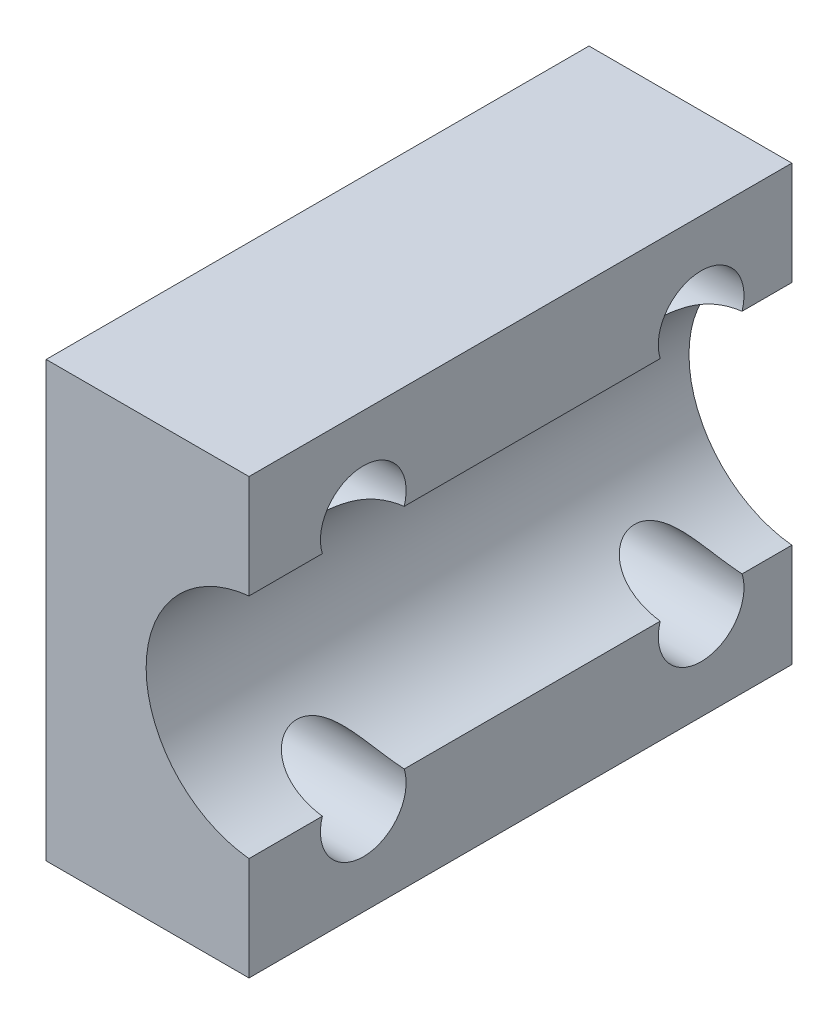
ISO-10303-21;
HEADER;
FILE_DESCRIPTION(('STEP AP214'),'2;1');
FILE_NAME('part.step','',(''),(''),'','','');
FILE_SCHEMA(('AUTOMOTIVE_DESIGN { 1 0 10303 214 1 1 1 1 }'));
ENDSEC;
DATA;
#1=APPLICATION_CONTEXT('core data for automotive mechanical design processes');
#2=APPLICATION_PROTOCOL_DEFINITION('international standard','automotive_design',2000,#1);
#3=PRODUCT_CONTEXT('',#1,'mechanical');
#4=PRODUCT('Part','Part','',(#3));
#5=PRODUCT_RELATED_PRODUCT_CATEGORY('part','',(#4));
#6=PRODUCT_DEFINITION_FORMATION('','',#4);
#7=PRODUCT_DEFINITION_CONTEXT('part definition',#1,'design');
#8=PRODUCT_DEFINITION('design','',#6,#7);
#9=PRODUCT_DEFINITION_SHAPE('','',#8);
#10=(LENGTH_UNIT() NAMED_UNIT(*) SI_UNIT(.MILLI.,.METRE.));
#11=(NAMED_UNIT(*) PLANE_ANGLE_UNIT() SI_UNIT($,.RADIAN.));
#12=(NAMED_UNIT(*) SI_UNIT($,.STERADIAN.) SOLID_ANGLE_UNIT());
#13=UNCERTAINTY_MEASURE_WITH_UNIT(LENGTH_MEASURE(1.E-05),#10,'distance_accuracy_value','');
#14=(GEOMETRIC_REPRESENTATION_CONTEXT(3) GLOBAL_UNCERTAINTY_ASSIGNED_CONTEXT((#13)) GLOBAL_UNIT_ASSIGNED_CONTEXT((#10,
#11,#12)) REPRESENTATION_CONTEXT('',''));
#15=CARTESIAN_POINT('',(0.,0.,0.));
#16=DIRECTION('',(0.,0.,1.));
#17=DIRECTION('',(1.,0.,0.));
#18=AXIS2_PLACEMENT_3D('',#15,#16,#17);
#19=CARTESIAN_POINT('',(0.,0.,19.));
#20=DIRECTION('',(0.,0.,-1.));
#21=DIRECTION('',(-1.,0.,0.));
#22=AXIS2_PLACEMENT_3D('',#19,#20,#21);
#23=CYLINDRICAL_SURFACE('',#22,4.);
#24=CARTESIAN_POINT('',(0.,0.,0.));
#25=DIRECTION('',(0.,0.,-1.));
#26=DIRECTION('',(1.,0.,0.));
#27=AXIS2_PLACEMENT_3D('',#24,#25,#26);
#28=CIRCLE('',#27,4.);
#29=CARTESIAN_POINT('',(-0.399999999999999,-3.97994974842648,0.));
#30=VERTEX_POINT('',#29);
#31=CARTESIAN_POINT('',(-0.4,3.97994974842648,0.));
#32=VERTEX_POINT('',#31);
#33=EDGE_CURVE('E130',#30,#32,#28,.T.);
#34=ORIENTED_EDGE('',*,*,#33,.T.);
#35=DIRECTION('',(0.,0.,-1.));
#36=VECTOR('',#35,1.);
#37=CARTESIAN_POINT('',(-0.4,3.97994974842648,19.));
#38=LINE('',#37,#36);
#39=CARTESIAN_POINT('',(-0.4,3.97994974842648,1.74254397150406));
#40=VERTEX_POINT('',#39);
#41=EDGE_CURVE('E110',#32,#40,#38,.F.);
#42=ORIENTED_EDGE('',*,*,#41,.T.);
#43=CARTESIAN_POINT('',(0.,4.,4.61353223808158));
#44=CARTESIAN_POINT('',(-0.0528760925026171,3.9999999854628,4.61352832943384));
#45=CARTESIAN_POINT('',(-0.105745845284585,3.99895133007558,4.61322296375461));
#46=CARTESIAN_POINT('',(-0.211397147419888,3.99475996833064,4.61197610061871));
#47=CARTESIAN_POINT('',(-0.26417869258438,3.99161716520755,4.61103457376658));
#48=CARTESIAN_POINT('',(-0.422400439857362,3.97904219003757,4.60720281068345));
#49=CARTESIAN_POINT('',(-0.527586866042493,3.96646346204618,4.60330523562459));
#50=CARTESIAN_POINT('',(-0.737501302300746,3.9328753177571,4.59208458851625));
#51=CARTESIAN_POINT('',(-0.842214027667608,3.91178227350895,4.58472741429962));
#52=CARTESIAN_POINT('',(-1.0491662660802,3.86142045240948,4.56536323146054));
#53=CARTESIAN_POINT('',(-1.15140776332044,3.83215848867779,4.5533600944974));
#54=CARTESIAN_POINT('',(-1.31354801386445,3.77873192310827,4.5288209761826));
#55=CARTESIAN_POINT('',(-1.3745491747335,3.75696363076586,4.51828131903091));
#56=CARTESIAN_POINT('',(-1.4949326439596,3.71070495402638,4.49426630655616));
#57=CARTESIAN_POINT('',(-1.55431496114116,3.68621458447139,4.48079096723946));
#58=CARTESIAN_POINT('',(-1.67088169867789,3.6348581902188,4.45036798777383));
#59=CARTESIAN_POINT('',(-1.72807312685636,3.60800084129172,4.43343275111438));
#60=CARTESIAN_POINT('',(-1.83999979906805,3.5522265009881,4.39541140823939));
#61=CARTESIAN_POINT('',(-1.89473585937175,3.52331020249166,4.37432669423693));
#62=CARTESIAN_POINT('',(-2.02403822913991,3.45120576194006,4.31721719670912));
#63=CARTESIAN_POINT('',(-2.0970730841073,3.4072031840298,4.27865953028382));
#64=CARTESIAN_POINT('',(-2.23493816646584,3.31839556876913,4.18957543932221));
#65=CARTESIAN_POINT('',(-2.29977975460475,3.27359174312255,4.13906587291378));
#66=CARTESIAN_POINT('',(-2.40502061883083,3.19673483242059,4.03779746057639));
#67=CARTESIAN_POINT('',(-2.44761260497697,3.16411759437957,3.98976310550594));
#68=CARTESIAN_POINT('',(-2.52508603565921,3.10264139502007,3.88564368796827));
#69=CARTESIAN_POINT('',(-2.55996952960312,3.07378143561816,3.82956077187693));
#70=CARTESIAN_POINT('',(-2.62097115055329,3.02194280365633,3.70954193955282));
#71=CARTESIAN_POINT('',(-2.64700866015642,2.99901865325228,3.64554068897879));
#72=CARTESIAN_POINT('',(-2.68872029401975,2.96168570936349,3.5119063675785));
#73=CARTESIAN_POINT('',(-2.70440379148338,2.94726921538878,3.44227845469609));
#74=CARTESIAN_POINT('',(-2.72323142684052,2.92987135829148,3.31047683539705));
#75=CARTESIAN_POINT('',(-2.72786662416181,2.92553264969981,3.24869034685718));
#76=CARTESIAN_POINT('',(-2.72890951473658,2.92456086988615,3.12499750552218));
#77=CARTESIAN_POINT('',(-2.72532069906484,2.92792452902618,3.06309121472942));
#78=CARTESIAN_POINT('',(-2.71055783028916,2.94159214474166,2.94524382588642));
#79=CARTESIAN_POINT('',(-2.69990434386796,2.95141944209224,2.88917988582956));
#80=CARTESIAN_POINT('',(-2.6718706696334,2.97682087181381,2.7801437321663));
#81=CARTESIAN_POINT('',(-2.65449072084676,2.99239479997575,2.72717140877539));
#82=CARTESIAN_POINT('',(-2.61264774294759,3.02900480373821,2.62331624579333));
#83=CARTESIAN_POINT('',(-2.58792085287491,3.05024062223057,2.57261117403533));
#84=CARTESIAN_POINT('',(-2.53242260494029,3.09647255464225,2.47652743503301));
#85=CARTESIAN_POINT('',(-2.50164813270174,3.1214706044713,2.43115153151454));
#86=CARTESIAN_POINT('',(-2.42069939906597,3.18493887198844,2.32806527757749));
#87=CARTESIAN_POINT('',(-2.36781990549666,3.22464138821733,2.27323460951817));
#88=CARTESIAN_POINT('',(-2.25357078841059,3.30550011804976,2.1745938286185));
#89=CARTESIAN_POINT('',(-2.19218527472418,3.34665894246384,2.13080478479719));
#90=CARTESIAN_POINT('',(-2.08091832747046,3.41655215796129,2.06383952210478));
#91=CARTESIAN_POINT('',(-2.03258133087606,3.44556033793051,2.03831687525903));
#92=CARTESIAN_POINT('',(-1.93309298472281,3.50234778099223,1.99175931689786));
#93=CARTESIAN_POINT('',(-1.88194036903015,3.53012648091111,1.97072644543822));
#94=CARTESIAN_POINT('',(-1.72483715224535,3.61092202921894,1.91338424393309));
#95=CARTESIAN_POINT('',(-1.61537234467147,3.6613146543189,1.88290523036458));
#96=CARTESIAN_POINT('',(-1.41809772929821,3.74131411202459,1.83930242609174));
#97=CARTESIAN_POINT('',(-1.33159840239049,3.77298303579919,1.82375275499522));
#98=CARTESIAN_POINT('',(-1.15589538010105,3.83046188518722,1.79749287011462));
#99=CARTESIAN_POINT('',(-1.06669017124366,3.85626846068053,1.78678542003969));
#100=CARTESIAN_POINT('',(-0.886382194361467,3.90166350172816,1.76904432718698));
#101=CARTESIAN_POINT('',(-0.795279570730446,3.92125243861737,1.76201040590724));
#102=CARTESIAN_POINT('',(-0.611804970087038,3.95403251487471,1.75074963609059));
#103=CARTESIAN_POINT('',(-0.519433622663302,3.96722671742344,1.74652144320562));
#104=CARTESIAN_POINT('',(-0.355757655538253,3.98478691670108,1.74102753142817));
#105=CARTESIAN_POINT('',(-0.284608922806099,3.99049952067382,1.73929889965765));
#106=CARTESIAN_POINT('',(-0.14230748658339,3.99810125819795,1.73702897929337));
#107=CARTESIAN_POINT('',(-0.0711554659214027,4.00000207655276,1.73648406166499));
#108=CARTESIAN_POINT('',(0.,4.,1.73646776191842));
#109=B_SPLINE_CURVE_WITH_KNOTS('',3,(#43,#44,#45,#46,#47,#48,#49,#50,#51,#52,#53,#54,#55,#56,
#57,#58,#59,#60,#61,#62,#63,#64,#65,#66,#67,#68,#69,#70,#71,#72,#73,#74,#75,#76,#77,#78,#79,#80,
#81,#82,#83,#84,#85,#86,#87,#88,#89,#90,#91,#92,#93,#94,#95,#96,#97,#98,#99,#100,#101,#102,#103,
#104,#105,#106,#107,#108),.UNSPECIFIED.,.F.,.F.,(4,2,2,2,2,2,2,2,2,2,2,2,2,2,2,2,2,2,2,2,2,2,2,
2,2,2,2,2,2,2,2,2,4),(0.,0.15860418949665,0.317215708209002,0.634830193096845,0.955643306909501,
1.27618964842636,1.47293227862556,1.66967383614253,1.86572208982324,2.06170467811574,
2.34150998430544,2.62092295387693,2.83612807080037,3.05127590348607,3.26833494188547,
3.48519721225336,3.67054390909058,3.85581194125326,4.02875326692487,4.20168844764229,
4.38179570935781,4.56199596671309,4.81826915777556,5.07502771649733,5.26042495187225,
5.44590624922426,5.81737942771681,6.09731769956896,6.37741554582589,6.65749215388515,
6.93743446781914,7.1515232577322,7.36495476172151),.UNSPECIFIED.);
#110=CARTESIAN_POINT('',(-0.4,3.97994974842648,4.60745602849594));
#111=VERTEX_POINT('',#110);
#112=EDGE_CURVE('E134',#111,#40,#109,.T.);
#113=ORIENTED_EDGE('',*,*,#112,.F.);
#114=CARTESIAN_POINT('',(-0.4,3.97994974842648,13.5675439715041));
#115=VERTEX_POINT('',#114);
#116=EDGE_CURVE('E210',#111,#115,#38,.F.);
#117=ORIENTED_EDGE('',*,*,#116,.T.);
#118=CARTESIAN_POINT('',(0.,4.,16.4385322380816));
#119=CARTESIAN_POINT('',(-0.052876092502617,3.9999999854628,16.4385283294338));
#120=CARTESIAN_POINT('',(-0.105745845284585,3.99895133007558,16.4382229637546));
#121=CARTESIAN_POINT('',(-0.211397147419888,3.99475996833064,16.4369761006187));
#122=CARTESIAN_POINT('',(-0.26417869258438,3.99161716520755,16.4360345737666));
#123=CARTESIAN_POINT('',(-0.422400439857362,3.97904219003757,16.4322028106834));
#124=CARTESIAN_POINT('',(-0.527586866042493,3.96646346204618,16.4283052356246));
#125=CARTESIAN_POINT('',(-0.737501302300746,3.9328753177571,16.4170845885163));
#126=CARTESIAN_POINT('',(-0.842214027667608,3.91178227350895,16.4097274142996));
#127=CARTESIAN_POINT('',(-1.0491662660802,3.86142045240948,16.3903632314605));
#128=CARTESIAN_POINT('',(-1.15140776332044,3.83215848867779,16.3783600944974));
#129=CARTESIAN_POINT('',(-1.31354801386445,3.77873192310827,16.3538209761826));
#130=CARTESIAN_POINT('',(-1.37454917473351,3.75696363076586,16.3432813190309));
#131=CARTESIAN_POINT('',(-1.4949326439596,3.71070495402638,16.3192663065562));
#132=CARTESIAN_POINT('',(-1.55431496114116,3.68621458447139,16.3057909672395));
#133=CARTESIAN_POINT('',(-1.67088169867789,3.6348581902188,16.2753679877738));
#134=CARTESIAN_POINT('',(-1.72807312685636,3.60800084129172,16.2584327511144));
#135=CARTESIAN_POINT('',(-1.83999979906805,3.5522265009881,16.2204114082394));
#136=CARTESIAN_POINT('',(-1.89473585937175,3.52331020249165,16.1993266942369));
#137=CARTESIAN_POINT('',(-2.02403822913991,3.45120576194006,16.1422171967091));
#138=CARTESIAN_POINT('',(-2.0970730841073,3.4072031840298,16.1036595302838));
#139=CARTESIAN_POINT('',(-2.23493816646584,3.31839556876913,16.0145754393222));
#140=CARTESIAN_POINT('',(-2.29977975460475,3.27359174312255,15.9640658729138));
#141=CARTESIAN_POINT('',(-2.40502061883083,3.19673483242059,15.8627974605764));
#142=CARTESIAN_POINT('',(-2.44761260497697,3.16411759437957,15.8147631055059));
#143=CARTESIAN_POINT('',(-2.52508603565921,3.10264139502007,15.7106436879683));
#144=CARTESIAN_POINT('',(-2.55996952960312,3.07378143561816,15.6545607718769));
#145=CARTESIAN_POINT('',(-2.62097115055329,3.02194280365633,15.5345419395528));
#146=CARTESIAN_POINT('',(-2.64700866015642,2.99901865325228,15.4705406889788));
#147=CARTESIAN_POINT('',(-2.68872029401975,2.96168570936349,15.3369063675785));
#148=CARTESIAN_POINT('',(-2.70440379148338,2.94726921538878,15.2672784546961));
#149=CARTESIAN_POINT('',(-2.72323142684053,2.92987135829148,15.135476835397));
#150=CARTESIAN_POINT('',(-2.72786662416181,2.92553264969981,15.0736903468572));
#151=CARTESIAN_POINT('',(-2.72890951473658,2.92456086988615,14.9499975055222));
#152=CARTESIAN_POINT('',(-2.72532069906484,2.92792452902618,14.8880912147294));
#153=CARTESIAN_POINT('',(-2.71055783028916,2.94159214474165,14.7702438258864));
#154=CARTESIAN_POINT('',(-2.69990434386796,2.95141944209224,14.7141798858296));
#155=CARTESIAN_POINT('',(-2.6718706696334,2.97682087181381,14.6051437321663));
#156=CARTESIAN_POINT('',(-2.65449072084676,2.99239479997575,14.5521714087754));
#157=CARTESIAN_POINT('',(-2.61264774294759,3.02900480373821,14.4483162457933));
#158=CARTESIAN_POINT('',(-2.58792085287491,3.05024062223057,14.3976111740353));
#159=CARTESIAN_POINT('',(-2.53242260494029,3.09647255464225,14.301527435033));
#160=CARTESIAN_POINT('',(-2.50164813270174,3.1214706044713,14.2561515315145));
#161=CARTESIAN_POINT('',(-2.42069939906597,3.18493887198844,14.1530652775775));
#162=CARTESIAN_POINT('',(-2.36781990549666,3.22464138821733,14.0982346095182));
#163=CARTESIAN_POINT('',(-2.25357078841059,3.30550011804976,13.9995938286185));
#164=CARTESIAN_POINT('',(-2.19218527472418,3.34665894246384,13.9558047847972));
#165=CARTESIAN_POINT('',(-2.08091832747046,3.41655215796129,13.8888395221048));
#166=CARTESIAN_POINT('',(-2.03258133087606,3.44556033793051,13.863316875259));
#167=CARTESIAN_POINT('',(-1.93309298472281,3.50234778099222,13.8167593168979));
#168=CARTESIAN_POINT('',(-1.88194036903015,3.53012648091111,13.7957264454382));
#169=CARTESIAN_POINT('',(-1.72483715224535,3.61092202921894,13.7383842439331));
#170=CARTESIAN_POINT('',(-1.61537234467147,3.6613146543189,13.7079052303646));
#171=CARTESIAN_POINT('',(-1.41809772929821,3.74131411202459,13.6643024260917));
#172=CARTESIAN_POINT('',(-1.33159840239049,3.77298303579919,13.6487527549952));
#173=CARTESIAN_POINT('',(-1.15589538010104,3.83046188518722,13.6224928701146));
#174=CARTESIAN_POINT('',(-1.06669017124366,3.85626846068053,13.6117854200397));
#175=CARTESIAN_POINT('',(-0.886382194361464,3.90166350172816,13.594044327187));
#176=CARTESIAN_POINT('',(-0.795279570730443,3.92125243861737,13.5870104059072));
#177=CARTESIAN_POINT('',(-0.611804970087035,3.95403251487471,13.5757496360906));
#178=CARTESIAN_POINT('',(-0.519433622663298,3.96722671742344,13.5715214432056));
#179=CARTESIAN_POINT('',(-0.35575765553825,3.98478691670108,13.5660275314282));
#180=CARTESIAN_POINT('',(-0.284608922806097,3.99049952067382,13.5642988996576));
#181=CARTESIAN_POINT('',(-0.142307486583389,3.99810125819795,13.5620289792934));
#182=CARTESIAN_POINT('',(-0.071155465921402,4.00000207655276,13.561484061665));
#183=CARTESIAN_POINT('',(0.,4.,13.5614677619184));
#184=B_SPLINE_CURVE_WITH_KNOTS('',3,(#118,#119,#120,#121,#122,#123,#124,#125,#126,#127,#128,
#129,#130,#131,#132,#133,#134,#135,#136,#137,#138,#139,#140,#141,#142,#143,#144,#145,#146,#147,
#148,#149,#150,#151,#152,#153,#154,#155,#156,#157,#158,#159,#160,#161,#162,#163,#164,#165,#166,
#167,#168,#169,#170,#171,#172,#173,#174,#175,#176,#177,#178,#179,#180,#181,#182,#183),
.UNSPECIFIED.,.F.,.F.,(4,2,2,2,2,2,2,2,2,2,2,2,2,2,2,2,2,2,2,2,2,2,2,2,2,2,2,2,2,2,2,2,4),(0.,
0.15860418949665,0.317215708209002,0.634830193096845,0.955643306909501,1.27618964842636,
1.47293227862556,1.66967383614253,1.86572208982324,2.06170467811574,2.34150998430544,
2.62092295387693,2.83612807080037,3.05127590348607,3.26833494188547,3.48519721225336,
3.67054390909058,3.85581194125326,4.02875326692487,4.20168844764229,4.38179570935782,
4.5619959667131,4.81826915777556,5.07502771649733,5.26042495187226,5.44590624922426,
5.81737942771681,6.09731769956897,6.3774155458259,6.65749215388516,6.93743446781914,
7.15152325773221,7.36495476172151),.UNSPECIFIED.);
#185=CARTESIAN_POINT('',(-0.4,3.97994974842648,16.4324560284959));
#186=VERTEX_POINT('',#185);
#187=EDGE_CURVE('E209',#186,#115,#184,.T.);
#188=ORIENTED_EDGE('',*,*,#187,.F.);
#189=CARTESIAN_POINT('',(-0.4,3.97994974842648,19.));
#190=VERTEX_POINT('',#189);
#191=EDGE_CURVE('E45',#186,#190,#38,.F.);
#192=ORIENTED_EDGE('',*,*,#191,.T.);
#193=CARTESIAN_POINT('',(0.,0.,19.));
#194=DIRECTION('',(0.,0.,-1.));
#195=DIRECTION('',(1.,0.,0.));
#196=AXIS2_PLACEMENT_3D('',#193,#194,#195);
#197=CIRCLE('',#196,4.);
#198=CARTESIAN_POINT('',(-0.399999999999999,-3.97994974842648,19.));
#199=VERTEX_POINT('',#198);
#200=EDGE_CURVE('E140',#199,#190,#197,.T.);
#201=ORIENTED_EDGE('',*,*,#200,.F.);
#202=DIRECTION('',(0.,0.,-1.));
#203=VECTOR('',#202,1.);
#204=CARTESIAN_POINT('',(-0.399999999999999,-3.97994974842648,19.));
#205=LINE('',#204,#203);
#206=CARTESIAN_POINT('',(-0.399999999999999,-3.97994974842648,16.4324560284959));
#207=VERTEX_POINT('',#206);
#208=EDGE_CURVE('E204',#199,#207,#205,.T.);
#209=ORIENTED_EDGE('',*,*,#208,.T.);
#210=CARTESIAN_POINT('',(0.,-4.,13.5614677619184));
#211=CARTESIAN_POINT('',(-0.052876092502617,-3.9999999854628,13.5614716705662));
#212=CARTESIAN_POINT('',(-0.105745845284585,-3.99895133007558,13.5617770362454));
#213=CARTESIAN_POINT('',(-0.211397147419888,-3.99475996833064,13.5630238993813));
#214=CARTESIAN_POINT('',(-0.264178692584379,-3.99161716520755,13.5639654262334));
#215=CARTESIAN_POINT('',(-0.422400439857362,-3.97904219003757,13.5677971893166));
#216=CARTESIAN_POINT('',(-0.527586866042492,-3.96646346204618,13.5716947643754));
#217=CARTESIAN_POINT('',(-0.737501302300745,-3.9328753177571,13.5829154114837));
#218=CARTESIAN_POINT('',(-0.842214027667607,-3.91178227350895,13.5902725857004));
#219=CARTESIAN_POINT('',(-1.0491662660802,-3.86142045240948,13.6096367685395));
#220=CARTESIAN_POINT('',(-1.15140776332044,-3.83215848867779,13.6216399055026));
#221=CARTESIAN_POINT('',(-1.31354801386445,-3.77873192310828,13.6461790238174));
#222=CARTESIAN_POINT('',(-1.3745491747335,-3.75696363076586,13.6567186809691));
#223=CARTESIAN_POINT('',(-1.4949326439596,-3.71070495402638,13.6807336934438));
#224=CARTESIAN_POINT('',(-1.55431496114116,-3.68621458447139,13.6942090327605));
#225=CARTESIAN_POINT('',(-1.67088169867789,-3.6348581902188,13.7246320122262));
#226=CARTESIAN_POINT('',(-1.72807312685635,-3.60800084129172,13.7415672488856));
#227=CARTESIAN_POINT('',(-1.83999979906805,-3.55222650098811,13.7795885917606));
#228=CARTESIAN_POINT('',(-1.89473585937175,-3.52331020249166,13.8006733057631));
#229=CARTESIAN_POINT('',(-2.0240382291399,-3.45120576194006,13.8577828032909));
#230=CARTESIAN_POINT('',(-2.0970730841073,-3.4072031840298,13.8963404697162));
#231=CARTESIAN_POINT('',(-2.23493816646584,-3.31839556876913,13.9854245606778));
#232=CARTESIAN_POINT('',(-2.29977975460474,-3.27359174312255,14.0359341270862));
#233=CARTESIAN_POINT('',(-2.40502061883083,-3.19673483242059,14.1372025394236));
#234=CARTESIAN_POINT('',(-2.44761260497697,-3.16411759437957,14.1852368944941));
#235=CARTESIAN_POINT('',(-2.5250860356592,-3.10264139502008,14.2893563120317));
#236=CARTESIAN_POINT('',(-2.55996952960311,-3.07378143561816,14.3454392281231));
#237=CARTESIAN_POINT('',(-2.62097115055328,-3.02194280365634,14.4654580604472));
#238=CARTESIAN_POINT('',(-2.64700866015641,-2.99901865325229,14.5294593110212));
#239=CARTESIAN_POINT('',(-2.68872029401974,-2.9616857093635,14.6630936324215));
#240=CARTESIAN_POINT('',(-2.70440379148337,-2.94726921538879,14.7327215453039));
#241=CARTESIAN_POINT('',(-2.72323142684052,-2.92987135829149,14.864523164603));
#242=CARTESIAN_POINT('',(-2.7278666241618,-2.92553264969982,14.9263096531428));
#243=CARTESIAN_POINT('',(-2.72890951473658,-2.92456086988616,15.0500024944778));
#244=CARTESIAN_POINT('',(-2.72532069906483,-2.92792452902619,15.1119087852706));
#245=CARTESIAN_POINT('',(-2.71055783028915,-2.94159214474166,15.2297561741136));
#246=CARTESIAN_POINT('',(-2.69990434386795,-2.95141944209225,15.2858201141704));
#247=CARTESIAN_POINT('',(-2.67187066963339,-2.97682087181382,15.3948562678337));
#248=CARTESIAN_POINT('',(-2.65449072084675,-2.99239479997576,15.4478285912246));
#249=CARTESIAN_POINT('',(-2.61264774294758,-3.02900480373822,15.5516837542067));
#250=CARTESIAN_POINT('',(-2.5879208528749,-3.05024062223058,15.6023888259647));
#251=CARTESIAN_POINT('',(-2.53242260494028,-3.09647255464226,15.698472564967));
#252=CARTESIAN_POINT('',(-2.50164813270173,-3.12147060447131,15.7438484684855));
#253=CARTESIAN_POINT('',(-2.42069939906596,-3.18493887198844,15.8469347224225));
#254=CARTESIAN_POINT('',(-2.36781990549665,-3.22464138821734,15.9017653904818));
#255=CARTESIAN_POINT('',(-2.25357078841058,-3.30550011804977,16.0004061713815));
#256=CARTESIAN_POINT('',(-2.19218527472417,-3.34665894246385,16.0441952152028));
#257=CARTESIAN_POINT('',(-2.08091832747045,-3.4165521579613,16.1111604778952));
#258=CARTESIAN_POINT('',(-2.03258133087605,-3.44556033793052,16.136683124741));
#259=CARTESIAN_POINT('',(-1.9330929847228,-3.50234778099223,16.1832406831021));
#260=CARTESIAN_POINT('',(-1.88194036903014,-3.53012648091112,16.2042735545618));
#261=CARTESIAN_POINT('',(-1.72483715224534,-3.61092202921895,16.2616157560669));
#262=CARTESIAN_POINT('',(-1.61537234467146,-3.66131465431891,16.2920947696354));
#263=CARTESIAN_POINT('',(-1.41809772929819,-3.7413141120246,16.3356975739083));
#264=CARTESIAN_POINT('',(-1.33159840239047,-3.77298303579919,16.3512472450048));
#265=CARTESIAN_POINT('',(-1.15589538010102,-3.83046188518723,16.3775071298854));
#266=CARTESIAN_POINT('',(-1.06669017124364,-3.85626846068054,16.3882145799603));
#267=CARTESIAN_POINT('',(-0.886382194361444,-3.90166350172816,16.405955672813));
#268=CARTESIAN_POINT('',(-0.795279570730422,-3.92125243861738,16.4129895940928));
#269=CARTESIAN_POINT('',(-0.611804970087013,-3.95403251487471,16.4242503639094));
#270=CARTESIAN_POINT('',(-0.519433622663276,-3.96722671742344,16.4284785567944));
#271=CARTESIAN_POINT('',(-0.355757655538231,-3.98478691670108,16.4339724685718));
#272=CARTESIAN_POINT('',(-0.284608922806082,-3.99049952067382,16.4357011003423));
#273=CARTESIAN_POINT('',(-0.142307486583381,-3.99810125819795,16.4379710207066));
#274=CARTESIAN_POINT('',(-0.0711554659213985,-4.00000207655276,16.438515938335));
#275=CARTESIAN_POINT('',(0.,-4.,16.4385322380816));
#276=B_SPLINE_CURVE_WITH_KNOTS('',3,(#210,#211,#212,#213,#214,#215,#216,#217,#218,#219,#220,
#221,#222,#223,#224,#225,#226,#227,#228,#229,#230,#231,#232,#233,#234,#235,#236,#237,#238,#239,
#240,#241,#242,#243,#244,#245,#246,#247,#248,#249,#250,#251,#252,#253,#254,#255,#256,#257,#258,
#259,#260,#261,#262,#263,#264,#265,#266,#267,#268,#269,#270,#271,#272,#273,#274,#275),
.UNSPECIFIED.,.F.,.F.,(4,2,2,2,2,2,2,2,2,2,2,2,2,2,2,2,2,2,2,2,2,2,2,2,2,2,2,2,2,2,2,2,4),(0.,
0.158604189496649,0.317215708209001,0.634830193096844,0.9556433069095,1.27618964842636,
1.47293227862556,1.66967383614253,1.86572208982324,2.06170467811573,2.34150998430543,
2.62092295387692,2.83612807080037,3.05127590348607,3.26833494188547,3.48519721225336,
3.67054390909057,3.85581194125325,4.02875326692486,4.20168844764228,4.38179570935781,
4.56199596671309,4.81826915777555,5.07502771649732,5.26042495187225,5.44590624922425,
5.8173794277168,6.09731769956896,6.37741554582589,6.65749215388515,6.93743446781914,
7.15152325773219,7.36495476172148),.UNSPECIFIED.);
#277=CARTESIAN_POINT('',(-0.399999999999999,-3.97994974842648,13.5675439715041));
#278=VERTEX_POINT('',#277);
#279=EDGE_CURVE('E240',#278,#207,#276,.T.);
#280=ORIENTED_EDGE('',*,*,#279,.F.);
#281=CARTESIAN_POINT('',(-0.399999999999999,-3.97994974842648,4.60745602849593));
#282=VERTEX_POINT('',#281);
#283=EDGE_CURVE('E337',#278,#282,#205,.T.);
#284=ORIENTED_EDGE('',*,*,#283,.T.);
#285=CARTESIAN_POINT('',(0.,-4.,1.73646776191842));
#286=CARTESIAN_POINT('',(-0.0528760925026171,-3.9999999854628,1.73647167056616));
#287=CARTESIAN_POINT('',(-0.105745845284585,-3.99895133007558,1.73677703624539));
#288=CARTESIAN_POINT('',(-0.211397147419888,-3.99475996833064,1.73802389938129));
#289=CARTESIAN_POINT('',(-0.26417869258438,-3.99161716520755,1.73896542623342));
#290=CARTESIAN_POINT('',(-0.422400439857362,-3.97904219003757,1.74279718931655));
#291=CARTESIAN_POINT('',(-0.527586866042493,-3.96646346204618,1.74669476437541));
#292=CARTESIAN_POINT('',(-0.737501302300746,-3.9328753177571,1.75791541148374));
#293=CARTESIAN_POINT('',(-0.842214027667608,-3.91178227350895,1.76527258570038));
#294=CARTESIAN_POINT('',(-1.0491662660802,-3.86142045240948,1.78463676853946));
#295=CARTESIAN_POINT('',(-1.15140776332044,-3.83215848867779,1.7966399055026));
#296=CARTESIAN_POINT('',(-1.31354801386445,-3.77873192310827,1.8211790238174));
#297=CARTESIAN_POINT('',(-1.3745491747335,-3.75696363076586,1.83171868096909));
#298=CARTESIAN_POINT('',(-1.4949326439596,-3.71070495402638,1.85573369344384));
#299=CARTESIAN_POINT('',(-1.55431496114116,-3.68621458447139,1.86920903276054));
#300=CARTESIAN_POINT('',(-1.67088169867789,-3.6348581902188,1.89963201222616));
#301=CARTESIAN_POINT('',(-1.72807312685636,-3.60800084129172,1.91656724888562));
#302=CARTESIAN_POINT('',(-1.83999979906805,-3.5522265009881,1.9545885917606));
#303=CARTESIAN_POINT('',(-1.89473585937175,-3.52331020249166,1.97567330576307));
#304=CARTESIAN_POINT('',(-2.0240382291399,-3.45120576194006,2.03278280329088));
#305=CARTESIAN_POINT('',(-2.0970730841073,-3.4072031840298,2.07134046971618));
#306=CARTESIAN_POINT('',(-2.23493816646584,-3.31839556876913,2.16042456067779));
#307=CARTESIAN_POINT('',(-2.29977975460474,-3.27359174312255,2.21093412708621));
#308=CARTESIAN_POINT('',(-2.40502061883083,-3.19673483242059,2.31220253942361));
#309=CARTESIAN_POINT('',(-2.44761260497697,-3.16411759437957,2.36023689449406));
#310=CARTESIAN_POINT('',(-2.52508603565921,-3.10264139502007,2.46435631203173));
#311=CARTESIAN_POINT('',(-2.55996952960312,-3.07378143561816,2.52043922812307));
#312=CARTESIAN_POINT('',(-2.62097115055328,-3.02194280365634,2.64045806044718));
#313=CARTESIAN_POINT('',(-2.64700866015642,-2.99901865325228,2.7044593110212));
#314=CARTESIAN_POINT('',(-2.68872029401975,-2.96168570936349,2.8380936324215));
#315=CARTESIAN_POINT('',(-2.70440379148337,-2.94726921538878,2.9077215453039));
#316=CARTESIAN_POINT('',(-2.72323142684052,-2.92987135829148,3.03952316460295));
#317=CARTESIAN_POINT('',(-2.72786662416181,-2.92553264969981,3.10130965314281));
#318=CARTESIAN_POINT('',(-2.72890951473658,-2.92456086988616,3.22500249447782));
#319=CARTESIAN_POINT('',(-2.72532069906484,-2.92792452902618,3.28690878527058));
#320=CARTESIAN_POINT('',(-2.71055783028916,-2.94159214474166,3.40475617411358));
#321=CARTESIAN_POINT('',(-2.69990434386796,-2.95141944209224,3.46082011417044));
#322=CARTESIAN_POINT('',(-2.6718706696334,-2.97682087181382,3.5698562678337));
#323=CARTESIAN_POINT('',(-2.65449072084676,-2.99239479997575,3.62282859122461));
#324=CARTESIAN_POINT('',(-2.61264774294758,-3.02900480373821,3.72668375420667));
#325=CARTESIAN_POINT('',(-2.58792085287491,-3.05024062223057,3.77738882596467));
#326=CARTESIAN_POINT('',(-2.53242260494029,-3.09647255464225,3.87347256496699));
#327=CARTESIAN_POINT('',(-2.50164813270174,-3.12147060447131,3.91884846848545));
#328=CARTESIAN_POINT('',(-2.42069939906597,-3.18493887198844,4.02193472242251));
#329=CARTESIAN_POINT('',(-2.36781990549666,-3.22464138821733,4.07676539048182));
#330=CARTESIAN_POINT('',(-2.25357078841059,-3.30550011804976,4.1754061713815));
#331=CARTESIAN_POINT('',(-2.19218527472417,-3.34665894246384,4.21919521520281));
#332=CARTESIAN_POINT('',(-2.08091832747046,-3.41655215796129,4.28616047789522));
#333=CARTESIAN_POINT('',(-2.03258133087606,-3.44556033793052,4.31168312474097));
#334=CARTESIAN_POINT('',(-1.93309298472281,-3.50234778099223,4.35824068310214));
#335=CARTESIAN_POINT('',(-1.88194036903015,-3.53012648091111,4.37927355456178));
#336=CARTESIAN_POINT('',(-1.72483715224535,-3.61092202921895,4.43661575606691));
#337=CARTESIAN_POINT('',(-1.61537234467147,-3.6613146543189,4.46709476963541));
#338=CARTESIAN_POINT('',(-1.41809772929821,-3.74131411202459,4.51069757390825));
#339=CARTESIAN_POINT('',(-1.33159840239049,-3.77298303579919,4.52624724500478));
#340=CARTESIAN_POINT('',(-1.15589538010104,-3.83046188518722,4.55250712988538));
#341=CARTESIAN_POINT('',(-1.06669017124366,-3.85626846068053,4.56321457996031));
#342=CARTESIAN_POINT('',(-0.886382194361465,-3.90166350172816,4.58095567281301));
#343=CARTESIAN_POINT('',(-0.795279570730443,-3.92125243861737,4.58798959409276));
#344=CARTESIAN_POINT('',(-0.611804970087035,-3.95403251487471,4.59925036390941));
#345=CARTESIAN_POINT('',(-0.519433622663299,-3.96722671742344,4.60347855679438));
#346=CARTESIAN_POINT('',(-0.35575765553825,-3.98478691670108,4.60897246857183));
#347=CARTESIAN_POINT('',(-0.284608922806097,-3.99049952067382,4.61070110034235));
#348=CARTESIAN_POINT('',(-0.142307486583389,-3.99810125819795,4.61297102070663));
#349=CARTESIAN_POINT('',(-0.071155465921402,-4.00000207655276,4.613515938335));
#350=CARTESIAN_POINT('',(0.,-4.,4.61353223808158));
#351=B_SPLINE_CURVE_WITH_KNOTS('',3,(#285,#286,#287,#288,#289,#290,#291,#292,#293,#294,#295,
#296,#297,#298,#299,#300,#301,#302,#303,#304,#305,#306,#307,#308,#309,#310,#311,#312,#313,#314,
#315,#316,#317,#318,#319,#320,#321,#322,#323,#324,#325,#326,#327,#328,#329,#330,#331,#332,#333,
#334,#335,#336,#337,#338,#339,#340,#341,#342,#343,#344,#345,#346,#347,#348,#349,#350),
.UNSPECIFIED.,.F.,.F.,(4,2,2,2,2,2,2,2,2,2,2,2,2,2,2,2,2,2,2,2,2,2,2,2,2,2,2,2,2,2,2,2,4),(0.,
0.15860418949665,0.317215708209002,0.634830193096845,0.955643306909501,1.27618964842636,
1.47293227862556,1.66967383614253,1.86572208982324,2.06170467811573,2.34150998430544,
2.62092295387693,2.83612807080037,3.05127590348607,3.26833494188547,3.48519721225336,
3.67054390909058,3.85581194125325,4.02875326692487,4.20168844764229,4.38179570935781,
4.56199596671309,4.81826915777556,5.07502771649733,5.26042495187225,5.44590624922426,
5.8173794277168,6.09731769956896,6.37741554582589,6.65749215388515,6.93743446781914,
7.1515232577322,7.3649547617215),.UNSPECIFIED.);
#352=CARTESIAN_POINT('',(-0.399999999999999,-3.97994974842648,1.74254397150406));
#353=VERTEX_POINT('',#352);
#354=EDGE_CURVE('E218',#353,#282,#351,.T.);
#355=ORIENTED_EDGE('',*,*,#354,.F.);
#356=EDGE_CURVE('E52',#353,#30,#205,.T.);
#357=ORIENTED_EDGE('',*,*,#356,.T.);
#358=EDGE_LOOP('',(#34,#42,#113,#117,#188,#192,#201,#209,#280,#284,#355,#357));
#359=FACE_BOUND('',#358,.T.);
#360=ADVANCED_FACE('F30',(#359),#23,.F.);
#361=CARTESIAN_POINT('',(-7.5,7.6,19.));
#362=DIRECTION('',(1.,0.,0.));
#363=DIRECTION('',(0.,0.,-1.));
#364=AXIS2_PLACEMENT_3D('',#361,#362,#363);
#365=PLANE('',#364);
#366=CARTESIAN_POINT('',(-7.5,-4.425,15.));
#367=DIRECTION('',(1.,0.,0.));
#368=DIRECTION('',(0.,0.,-1.));
#369=AXIS2_PLACEMENT_3D('',#366,#367,#368);
#370=CIRCLE('',#369,1.5);
#371=CARTESIAN_POINT('',(-7.5,-4.425,13.5));
#372=VERTEX_POINT('',#371);
#373=EDGE_CURVE('E228',#372,#372,#370,.T.);
#374=ORIENTED_EDGE('',*,*,#373,.T.);
#375=EDGE_LOOP('',(#374));
#376=FACE_BOUND('',#375,.T.);
#377=CARTESIAN_POINT('',(-7.5,4.425,3.175));
#378=DIRECTION('',(1.,0.,0.));
#379=DIRECTION('',(0.,0.,-1.));
#380=AXIS2_PLACEMENT_3D('',#377,#378,#379);
#381=CIRCLE('',#380,1.5);
#382=CARTESIAN_POINT('',(-7.5,4.425,1.675));
#383=VERTEX_POINT('',#382);
#384=EDGE_CURVE('E164',#383,#383,#381,.T.);
#385=ORIENTED_EDGE('',*,*,#384,.T.);
#386=EDGE_LOOP('',(#385));
#387=FACE_BOUND('',#386,.T.);
#388=DIRECTION('',(0.,-1.,0.));
#389=VECTOR('',#388,1.);
#390=CARTESIAN_POINT('',(-7.5,7.6,0.));
#391=LINE('',#390,#389);
#392=CARTESIAN_POINT('',(-7.5,7.6,0.));
#393=VERTEX_POINT('',#392);
#394=CARTESIAN_POINT('',(-7.5,-7.6,0.));
#395=VERTEX_POINT('',#394);
#396=EDGE_CURVE('E129',#393,#395,#391,.T.);
#397=ORIENTED_EDGE('',*,*,#396,.T.);
#398=DIRECTION('',(0.,0.,-1.));
#399=VECTOR('',#398,1.);
#400=CARTESIAN_POINT('',(-7.5,-7.6,19.));
#401=LINE('',#400,#399);
#402=CARTESIAN_POINT('',(-7.5,-7.6,19.));
#403=VERTEX_POINT('',#402);
#404=EDGE_CURVE('E141',#403,#395,#401,.T.);
#405=ORIENTED_EDGE('',*,*,#404,.F.);
#406=DIRECTION('',(0.,-1.,0.));
#407=VECTOR('',#406,1.);
#408=CARTESIAN_POINT('',(-7.5,7.6,19.));
#409=LINE('',#408,#407);
#410=CARTESIAN_POINT('',(-7.5,7.6,19.));
#411=VERTEX_POINT('',#410);
#412=EDGE_CURVE('E149',#411,#403,#409,.T.);
#413=ORIENTED_EDGE('',*,*,#412,.F.);
#414=DIRECTION('',(0.,0.,-1.));
#415=VECTOR('',#414,1.);
#416=CARTESIAN_POINT('',(-7.5,7.6,19.));
#417=LINE('',#416,#415);
#418=EDGE_CURVE('E38',#411,#393,#417,.T.);
#419=ORIENTED_EDGE('',*,*,#418,.T.);
#420=EDGE_LOOP('',(#397,#405,#413,#419));
#421=FACE_BOUND('',#420,.T.);
#422=CARTESIAN_POINT('',(-7.5,4.425,15.));
#423=DIRECTION('',(1.,0.,0.));
#424=DIRECTION('',(0.,0.,-1.));
#425=AXIS2_PLACEMENT_3D('',#422,#423,#424);
#426=CIRCLE('',#425,1.5);
#427=CARTESIAN_POINT('',(-7.5,4.425,13.5));
#428=VERTEX_POINT('',#427);
#429=EDGE_CURVE('E245',#428,#428,#426,.T.);
#430=ORIENTED_EDGE('',*,*,#429,.T.);
#431=EDGE_LOOP('',(#430));
#432=FACE_BOUND('',#431,.T.);
#433=CARTESIAN_POINT('',(-7.5,-4.425,3.175));
#434=DIRECTION('',(1.,0.,0.));
#435=DIRECTION('',(0.,0.,-1.));
#436=AXIS2_PLACEMENT_3D('',#433,#434,#435);
#437=CIRCLE('',#436,1.5);
#438=CARTESIAN_POINT('',(-7.5,-4.425,1.675));
#439=VERTEX_POINT('',#438);
#440=EDGE_CURVE('E216',#439,#439,#437,.T.);
#441=ORIENTED_EDGE('',*,*,#440,.T.);
#442=EDGE_LOOP('',(#441));
#443=FACE_BOUND('',#442,.T.);
#444=ADVANCED_FACE('F146',(#376,#387,#421,#432,#443),#365,.F.);
#445=CARTESIAN_POINT('',(0.,7.6,19.));
#446=DIRECTION('',(0.,-1.,0.));
#447=DIRECTION('',(0.,0.,-1.));
#448=AXIS2_PLACEMENT_3D('',#445,#446,#447);
#449=PLANE('',#448);
#450=DIRECTION('',(-1.,0.,0.));
#451=VECTOR('',#450,1.);
#452=CARTESIAN_POINT('',(0.,7.6,19.));
#453=LINE('',#452,#451);
#454=CARTESIAN_POINT('',(-0.4,7.6,19.));
#455=VERTEX_POINT('',#454);
#456=EDGE_CURVE('E123',#455,#411,#453,.T.);
#457=ORIENTED_EDGE('',*,*,#456,.F.);
#458=DIRECTION('',(0.,0.,1.));
#459=VECTOR('',#458,1.);
#460=CARTESIAN_POINT('',(-0.4,7.6,0.));
#461=LINE('',#460,#459);
#462=CARTESIAN_POINT('',(-0.4,7.6,0.));
#463=VERTEX_POINT('',#462);
#464=EDGE_CURVE('E107',#463,#455,#461,.T.);
#465=ORIENTED_EDGE('',*,*,#464,.F.);
#466=DIRECTION('',(-1.,0.,0.));
#467=VECTOR('',#466,1.);
#468=CARTESIAN_POINT('',(0.,7.6,0.));
#469=LINE('',#468,#467);
#470=EDGE_CURVE('E121',#463,#393,#469,.T.);
#471=ORIENTED_EDGE('',*,*,#470,.T.);
#472=ORIENTED_EDGE('',*,*,#418,.F.);
#473=EDGE_LOOP('',(#457,#465,#471,#472));
#474=FACE_BOUND('',#473,.T.);
#475=ADVANCED_FACE('F119',(#474),#449,.F.);
#476=CARTESIAN_POINT('',(0.,-7.6,19.));
#477=DIRECTION('',(0.,1.,0.));
#478=DIRECTION('',(-1.,0.,0.));
#479=AXIS2_PLACEMENT_3D('',#476,#477,#478);
#480=PLANE('',#479);
#481=DIRECTION('',(1.,0.,0.));
#482=VECTOR('',#481,1.);
#483=CARTESIAN_POINT('',(0.,-7.6,0.));
#484=LINE('',#483,#482);
#485=CARTESIAN_POINT('',(-0.399999999999998,-7.6,0.));
#486=VERTEX_POINT('',#485);
#487=EDGE_CURVE('E132',#395,#486,#484,.T.);
#488=ORIENTED_EDGE('',*,*,#487,.T.);
#489=DIRECTION('',(0.,0.,1.));
#490=VECTOR('',#489,1.);
#491=CARTESIAN_POINT('',(-0.399999999999998,-7.6,0.));
#492=LINE('',#491,#490);
#493=CARTESIAN_POINT('',(-0.399999999999998,-7.6,19.));
#494=VERTEX_POINT('',#493);
#495=EDGE_CURVE('E124',#486,#494,#492,.T.);
#496=ORIENTED_EDGE('',*,*,#495,.T.);
#497=DIRECTION('',(1.,0.,0.));
#498=VECTOR('',#497,1.);
#499=CARTESIAN_POINT('',(0.,-7.6,19.));
#500=LINE('',#499,#498);
#501=EDGE_CURVE('E143',#403,#494,#500,.T.);
#502=ORIENTED_EDGE('',*,*,#501,.F.);
#503=ORIENTED_EDGE('',*,*,#404,.T.);
#504=EDGE_LOOP('',(#488,#496,#502,#503));
#505=FACE_BOUND('',#504,.T.);
#506=ADVANCED_FACE('F178',(#505),#480,.F.);
#507=CARTESIAN_POINT('',(0.,0.,19.));
#508=DIRECTION('',(0.,0.,1.));
#509=DIRECTION('',(1.,0.,0.));
#510=AXIS2_PLACEMENT_3D('',#507,#508,#509);
#511=PLANE('',#510);
#512=DIRECTION('',(0.,-1.,0.));
#513=VECTOR('',#512,1.);
#514=CARTESIAN_POINT('',(-0.4,7.6,19.));
#515=LINE('',#514,#513);
#516=EDGE_CURVE('E196',#455,#190,#515,.T.);
#517=ORIENTED_EDGE('',*,*,#516,.F.);
#518=ORIENTED_EDGE('',*,*,#456,.T.);
#519=ORIENTED_EDGE('',*,*,#412,.T.);
#520=ORIENTED_EDGE('',*,*,#501,.T.);
#521=EDGE_CURVE('E199',#199,#494,#515,.T.);
#522=ORIENTED_EDGE('',*,*,#521,.F.);
#523=ORIENTED_EDGE('',*,*,#200,.T.);
#524=EDGE_LOOP('',(#517,#518,#519,#520,#522,#523));
#525=FACE_BOUND('',#524,.T.);
#526=ADVANCED_FACE('F175',(#525),#511,.T.);
#527=CARTESIAN_POINT('',(0.,0.,0.));
#528=DIRECTION('',(0.,0.,1.));
#529=DIRECTION('',(1.,0.,0.));
#530=AXIS2_PLACEMENT_3D('',#527,#528,#529);
#531=PLANE('',#530);
#532=ORIENTED_EDGE('',*,*,#470,.F.);
#533=DIRECTION('',(0.,-1.,0.));
#534=VECTOR('',#533,1.);
#535=CARTESIAN_POINT('',(-0.4,7.6,0.));
#536=LINE('',#535,#534);
#537=EDGE_CURVE('E104',#463,#32,#536,.T.);
#538=ORIENTED_EDGE('',*,*,#537,.T.);
#539=ORIENTED_EDGE('',*,*,#33,.F.);
#540=EDGE_CURVE('E115',#30,#486,#536,.T.);
#541=ORIENTED_EDGE('',*,*,#540,.T.);
#542=ORIENTED_EDGE('',*,*,#487,.F.);
#543=ORIENTED_EDGE('',*,*,#396,.F.);
#544=EDGE_LOOP('',(#532,#538,#539,#541,#542,#543));
#545=FACE_BOUND('',#544,.T.);
#546=ADVANCED_FACE('F127',(#545),#531,.F.);
#547=CARTESIAN_POINT('',(0.,4.425,3.175));
#548=DIRECTION('',(-1.,0.,0.));
#549=DIRECTION('',(0.,0.,1.));
#550=AXIS2_PLACEMENT_3D('',#547,#548,#549);
#551=CYLINDRICAL_SURFACE('',#550,1.5);
#552=CARTESIAN_POINT('',(-0.4,4.425,3.175));
#553=DIRECTION('',(-1.,0.,0.));
#554=DIRECTION('',(0.,-1.,0.));
#555=AXIS2_PLACEMENT_3D('',#552,#553,#554);
#556=CIRCLE('',#555,1.5);
#557=EDGE_CURVE('E213',#111,#40,#556,.T.);
#558=ORIENTED_EDGE('',*,*,#557,.F.);
#559=ORIENTED_EDGE('',*,*,#112,.T.);
#560=EDGE_LOOP('',(#558,#559));
#561=FACE_BOUND('',#560,.T.);
#562=ORIENTED_EDGE('',*,*,#384,.F.);
#563=EDGE_LOOP('',(#562));
#564=FACE_BOUND('',#563,.T.);
#565=ADVANCED_FACE('F166',(#561,#564),#551,.F.);
#566=CARTESIAN_POINT('',(0.,4.425,15.));
#567=DIRECTION('',(-1.,0.,0.));
#568=DIRECTION('',(0.,0.,1.));
#569=AXIS2_PLACEMENT_3D('',#566,#567,#568);
#570=CYLINDRICAL_SURFACE('',#569,1.5);
#571=CARTESIAN_POINT('',(-0.4,4.425,15.));
#572=DIRECTION('',(-1.,0.,0.));
#573=DIRECTION('',(0.,-1.,0.));
#574=AXIS2_PLACEMENT_3D('',#571,#572,#573);
#575=CIRCLE('',#574,1.5);
#576=EDGE_CURVE('E211',#186,#115,#575,.T.);
#577=ORIENTED_EDGE('',*,*,#576,.F.);
#578=ORIENTED_EDGE('',*,*,#187,.T.);
#579=EDGE_LOOP('',(#577,#578));
#580=FACE_BOUND('',#579,.T.);
#581=ORIENTED_EDGE('',*,*,#429,.F.);
#582=EDGE_LOOP('',(#581));
#583=FACE_BOUND('',#582,.T.);
#584=ADVANCED_FACE('F171',(#580,#583),#570,.F.);
#585=CARTESIAN_POINT('',(0.,-4.425,15.));
#586=DIRECTION('',(-1.,0.,0.));
#587=DIRECTION('',(0.,0.,1.));
#588=AXIS2_PLACEMENT_3D('',#585,#586,#587);
#589=CYLINDRICAL_SURFACE('',#588,1.5);
#590=CARTESIAN_POINT('',(-0.399999999999999,-4.425,15.));
#591=DIRECTION('',(-1.,0.,0.));
#592=DIRECTION('',(0.,-1.,0.));
#593=AXIS2_PLACEMENT_3D('',#590,#591,#592);
#594=CIRCLE('',#593,1.5);
#595=EDGE_CURVE('E335',#278,#207,#594,.T.);
#596=ORIENTED_EDGE('',*,*,#595,.F.);
#597=ORIENTED_EDGE('',*,*,#279,.T.);
#598=EDGE_LOOP('',(#596,#597));
#599=FACE_BOUND('',#598,.T.);
#600=ORIENTED_EDGE('',*,*,#373,.F.);
#601=EDGE_LOOP('',(#600));
#602=FACE_BOUND('',#601,.T.);
#603=ADVANCED_FACE('F235',(#599,#602),#589,.F.);
#604=CARTESIAN_POINT('',(0.,-4.425,3.175));
#605=DIRECTION('',(-1.,0.,0.));
#606=DIRECTION('',(0.,0.,1.));
#607=AXIS2_PLACEMENT_3D('',#604,#605,#606);
#608=CYLINDRICAL_SURFACE('',#607,1.5);
#609=CARTESIAN_POINT('',(-0.399999999999999,-4.425,3.175));
#610=DIRECTION('',(-1.,0.,0.));
#611=DIRECTION('',(0.,-1.,0.));
#612=AXIS2_PLACEMENT_3D('',#609,#610,#611);
#613=CIRCLE('',#612,1.5);
#614=EDGE_CURVE('E11',#353,#282,#613,.T.);
#615=ORIENTED_EDGE('',*,*,#614,.F.);
#616=ORIENTED_EDGE('',*,*,#354,.T.);
#617=EDGE_LOOP('',(#615,#616));
#618=FACE_BOUND('',#617,.T.);
#619=ORIENTED_EDGE('',*,*,#440,.F.);
#620=EDGE_LOOP('',(#619));
#621=FACE_BOUND('',#620,.T.);
#622=ADVANCED_FACE('F230',(#618,#621),#608,.F.);
#623=CARTESIAN_POINT('',(-0.4,7.6,0.));
#624=DIRECTION('',(-1.,0.,0.));
#625=DIRECTION('',(0.,-1.,0.));
#626=AXIS2_PLACEMENT_3D('',#623,#624,#625);
#627=PLANE('',#626);
#628=ORIENTED_EDGE('',*,*,#521,.T.);
#629=ORIENTED_EDGE('',*,*,#495,.F.);
#630=ORIENTED_EDGE('',*,*,#540,.F.);
#631=ORIENTED_EDGE('',*,*,#356,.F.);
#632=ORIENTED_EDGE('',*,*,#614,.T.);
#633=ORIENTED_EDGE('',*,*,#283,.F.);
#634=ORIENTED_EDGE('',*,*,#595,.T.);
#635=ORIENTED_EDGE('',*,*,#208,.F.);
#636=EDGE_LOOP('',(#628,#629,#630,#631,#632,#633,#634,#635));
#637=FACE_BOUND('',#636,.T.);
#638=ADVANCED_FACE('F234',(#637),#627,.F.);
#639=ORIENTED_EDGE('',*,*,#537,.F.);
#640=ORIENTED_EDGE('',*,*,#464,.T.);
#641=ORIENTED_EDGE('',*,*,#516,.T.);
#642=ORIENTED_EDGE('',*,*,#191,.F.);
#643=ORIENTED_EDGE('',*,*,#576,.T.);
#644=ORIENTED_EDGE('',*,*,#116,.F.);
#645=ORIENTED_EDGE('',*,*,#557,.T.);
#646=ORIENTED_EDGE('',*,*,#41,.F.);
#647=EDGE_LOOP('',(#639,#640,#641,#642,#643,#644,#645,#646));
#648=FACE_BOUND('',#647,.T.);
#649=ADVANCED_FACE('F106',(#648),#627,.F.);
#650=CLOSED_SHELL('',(#360,#444,#475,#506,#526,#546,#565,#584,#603,#622,#638,#649));
#651=MANIFOLD_SOLID_BREP('B2',#650);
#652=ADVANCED_BREP_SHAPE_REPRESENTATION('',(#18,#651),#14);
#653=SHAPE_DEFINITION_REPRESENTATION(#9,#652);
ENDSEC;
END-ISO-10303-21;
